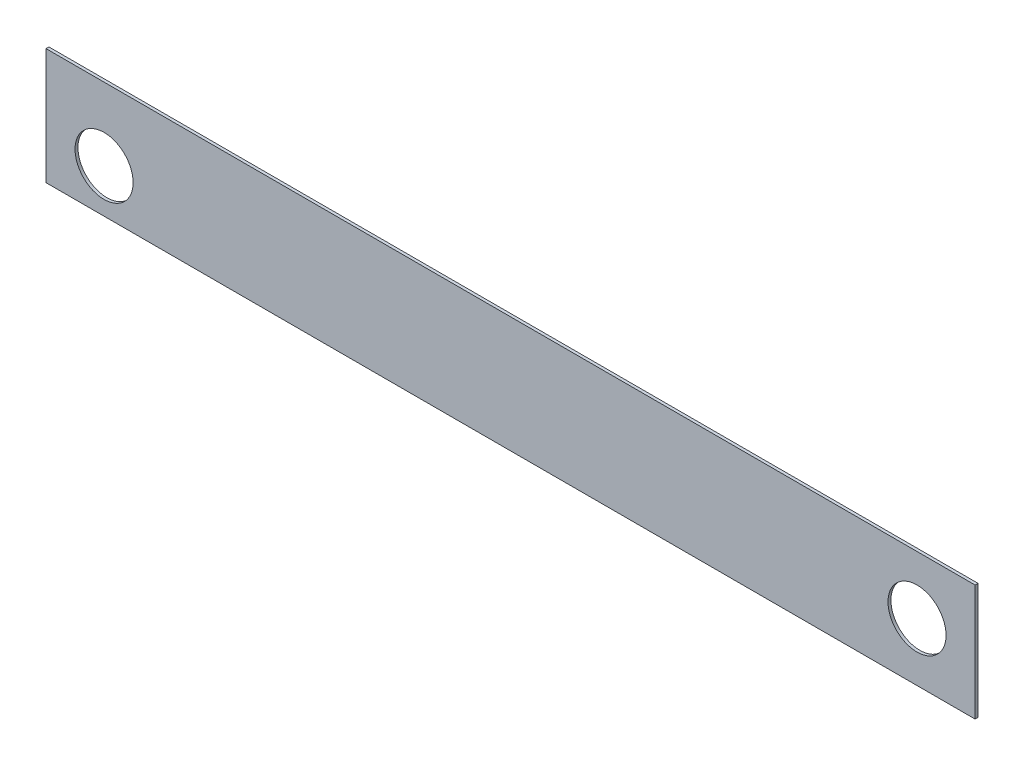
ISO-10303-21;
HEADER;
FILE_DESCRIPTION(('STEP AP214'),'2;1');
FILE_NAME('part.step','',(''),(''),'','','');
FILE_SCHEMA(('AUTOMOTIVE_DESIGN { 1 0 10303 214 1 1 1 1 }'));
ENDSEC;
DATA;
#1=APPLICATION_CONTEXT('core data for automotive mechanical design processes');
#2=APPLICATION_PROTOCOL_DEFINITION('international standard','automotive_design',2000,#1);
#3=PRODUCT_CONTEXT('',#1,'mechanical');
#4=PRODUCT('Part','Part','',(#3));
#5=PRODUCT_RELATED_PRODUCT_CATEGORY('part','',(#4));
#6=PRODUCT_DEFINITION_FORMATION('','',#4);
#7=PRODUCT_DEFINITION_CONTEXT('part definition',#1,'design');
#8=PRODUCT_DEFINITION('design','',#6,#7);
#9=PRODUCT_DEFINITION_SHAPE('','',#8);
#10=(LENGTH_UNIT() NAMED_UNIT(*) SI_UNIT(.MILLI.,.METRE.));
#11=(NAMED_UNIT(*) PLANE_ANGLE_UNIT() SI_UNIT($,.RADIAN.));
#12=(NAMED_UNIT(*) SI_UNIT($,.STERADIAN.) SOLID_ANGLE_UNIT());
#13=UNCERTAINTY_MEASURE_WITH_UNIT(LENGTH_MEASURE(1.E-05),#10,'distance_accuracy_value','');
#14=(GEOMETRIC_REPRESENTATION_CONTEXT(3) GLOBAL_UNCERTAINTY_ASSIGNED_CONTEXT((#13)) GLOBAL_UNIT_ASSIGNED_CONTEXT((#10,
#11,#12)) REPRESENTATION_CONTEXT('',''));
#15=CARTESIAN_POINT('',(0.,0.,0.));
#16=DIRECTION('',(0.,0.,1.));
#17=DIRECTION('',(1.,0.,0.));
#18=AXIS2_PLACEMENT_3D('',#15,#16,#17);
#19=CARTESIAN_POINT('',(-20.,25.,1.));
#20=DIRECTION('',(0.,0.,1.));
#21=DIRECTION('',(1.,0.,0.));
#22=AXIS2_PLACEMENT_3D('',#19,#20,#21);
#23=PLANE('',#22);
#24=CARTESIAN_POINT('',(0.,0.,1.));
#25=DIRECTION('',(0.,0.,1.));
#26=DIRECTION('',(1.,0.,0.));
#27=AXIS2_PLACEMENT_3D('',#24,#25,#26);
#28=CIRCLE('',#27,10.);
#29=CARTESIAN_POINT('',(10.,0.,1.));
#30=VERTEX_POINT('',#29);
#31=EDGE_CURVE('E106',#30,#30,#28,.T.);
#32=ORIENTED_EDGE('',*,*,#31,.F.);
#33=EDGE_LOOP('',(#32));
#34=FACE_BOUND('',#33,.T.);
#35=DIRECTION('',(0.,-1.,0.));
#36=VECTOR('',#35,1.);
#37=CARTESIAN_POINT('',(-20.,25.,1.));
#38=LINE('',#37,#36);
#39=CARTESIAN_POINT('',(-20.,25.,1.));
#40=VERTEX_POINT('',#39);
#41=CARTESIAN_POINT('',(-20.,-15.,1.));
#42=VERTEX_POINT('',#41);
#43=EDGE_CURVE('E91',#40,#42,#38,.T.);
#44=ORIENTED_EDGE('',*,*,#43,.T.);
#45=DIRECTION('',(1.,0.,0.));
#46=VECTOR('',#45,1.);
#47=CARTESIAN_POINT('',(-20.,-15.,1.));
#48=LINE('',#47,#46);
#49=CARTESIAN_POINT('',(300.,-15.,1.));
#50=VERTEX_POINT('',#49);
#51=EDGE_CURVE('E86',#42,#50,#48,.T.);
#52=ORIENTED_EDGE('',*,*,#51,.T.);
#53=DIRECTION('',(0.,1.,0.));
#54=VECTOR('',#53,1.);
#55=CARTESIAN_POINT('',(300.,25.,1.));
#56=LINE('',#55,#54);
#57=CARTESIAN_POINT('',(300.,25.,1.));
#58=VERTEX_POINT('',#57);
#59=EDGE_CURVE('E89',#50,#58,#56,.T.);
#60=ORIENTED_EDGE('',*,*,#59,.T.);
#61=DIRECTION('',(-1.,0.,0.));
#62=VECTOR('',#61,1.);
#63=CARTESIAN_POINT('',(-20.,25.,1.));
#64=LINE('',#63,#62);
#65=EDGE_CURVE('E56',#58,#40,#64,.T.);
#66=ORIENTED_EDGE('',*,*,#65,.T.);
#67=EDGE_LOOP('',(#44,#52,#60,#66));
#68=FACE_BOUND('',#67,.T.);
#69=CARTESIAN_POINT('',(280.,5.,1.));
#70=DIRECTION('',(0.,0.,1.));
#71=DIRECTION('',(1.,0.,0.));
#72=AXIS2_PLACEMENT_3D('',#69,#70,#71);
#73=CIRCLE('',#72,9.99999999999998);
#74=CARTESIAN_POINT('',(290.,5.,1.));
#75=VERTEX_POINT('',#74);
#76=EDGE_CURVE('E121',#75,#75,#73,.T.);
#77=ORIENTED_EDGE('',*,*,#76,.F.);
#78=EDGE_LOOP('',(#77));
#79=FACE_BOUND('',#78,.T.);
#80=ADVANCED_FACE('F39',(#34,#68,#79),#23,.T.);
#81=CARTESIAN_POINT('',(-20.,25.,0.));
#82=DIRECTION('',(0.,0.,1.));
#83=DIRECTION('',(1.,0.,0.));
#84=AXIS2_PLACEMENT_3D('',#81,#82,#83);
#85=PLANE('',#84);
#86=CARTESIAN_POINT('',(0.,0.,0.));
#87=DIRECTION('',(0.,0.,1.));
#88=DIRECTION('',(1.,0.,0.));
#89=AXIS2_PLACEMENT_3D('',#86,#87,#88);
#90=CIRCLE('',#89,10.);
#91=CARTESIAN_POINT('',(10.,0.,0.));
#92=VERTEX_POINT('',#91);
#93=EDGE_CURVE('E118',#92,#92,#90,.T.);
#94=ORIENTED_EDGE('',*,*,#93,.T.);
#95=EDGE_LOOP('',(#94));
#96=FACE_BOUND('',#95,.T.);
#97=DIRECTION('',(0.,-1.,0.));
#98=VECTOR('',#97,1.);
#99=CARTESIAN_POINT('',(-20.,25.,0.));
#100=LINE('',#99,#98);
#101=CARTESIAN_POINT('',(-20.,25.,0.));
#102=VERTEX_POINT('',#101);
#103=CARTESIAN_POINT('',(-20.,-15.,0.));
#104=VERTEX_POINT('',#103);
#105=EDGE_CURVE('E103',#102,#104,#100,.T.);
#106=ORIENTED_EDGE('',*,*,#105,.F.);
#107=DIRECTION('',(-1.,0.,0.));
#108=VECTOR('',#107,1.);
#109=CARTESIAN_POINT('',(-20.,25.,0.));
#110=LINE('',#109,#108);
#111=CARTESIAN_POINT('',(300.,25.,0.));
#112=VERTEX_POINT('',#111);
#113=EDGE_CURVE('E79',#112,#102,#110,.T.);
#114=ORIENTED_EDGE('',*,*,#113,.F.);
#115=DIRECTION('',(0.,1.,0.));
#116=VECTOR('',#115,1.);
#117=CARTESIAN_POINT('',(300.,25.,0.));
#118=LINE('',#117,#116);
#119=CARTESIAN_POINT('',(300.,-15.,0.));
#120=VERTEX_POINT('',#119);
#121=EDGE_CURVE('E73',#120,#112,#118,.T.);
#122=ORIENTED_EDGE('',*,*,#121,.F.);
#123=DIRECTION('',(1.,0.,0.));
#124=VECTOR('',#123,1.);
#125=CARTESIAN_POINT('',(-20.,-15.,0.));
#126=LINE('',#125,#124);
#127=EDGE_CURVE('E95',#104,#120,#126,.T.);
#128=ORIENTED_EDGE('',*,*,#127,.F.);
#129=EDGE_LOOP('',(#106,#114,#122,#128));
#130=FACE_BOUND('',#129,.T.);
#131=CARTESIAN_POINT('',(280.,5.,0.));
#132=DIRECTION('',(0.,0.,1.));
#133=DIRECTION('',(1.,0.,0.));
#134=AXIS2_PLACEMENT_3D('',#131,#132,#133);
#135=CIRCLE('',#134,9.99999999999998);
#136=CARTESIAN_POINT('',(290.,5.,0.));
#137=VERTEX_POINT('',#136);
#138=EDGE_CURVE('E124',#137,#137,#135,.T.);
#139=ORIENTED_EDGE('',*,*,#138,.T.);
#140=EDGE_LOOP('',(#139));
#141=FACE_BOUND('',#140,.T.);
#142=ADVANCED_FACE('F114',(#96,#130,#141),#85,.F.);
#143=CARTESIAN_POINT('',(-20.,25.,1.));
#144=DIRECTION('',(1.,0.,0.));
#145=DIRECTION('',(0.,1.,0.));
#146=AXIS2_PLACEMENT_3D('',#143,#144,#145);
#147=PLANE('',#146);
#148=ORIENTED_EDGE('',*,*,#105,.T.);
#149=DIRECTION('',(0.,0.,-1.));
#150=VECTOR('',#149,1.);
#151=CARTESIAN_POINT('',(-20.,-15.,1.));
#152=LINE('',#151,#150);
#153=EDGE_CURVE('E11',#42,#104,#152,.T.);
#154=ORIENTED_EDGE('',*,*,#153,.F.);
#155=ORIENTED_EDGE('',*,*,#43,.F.);
#156=DIRECTION('',(0.,0.,-1.));
#157=VECTOR('',#156,1.);
#158=CARTESIAN_POINT('',(-20.,25.,1.));
#159=LINE('',#158,#157);
#160=EDGE_CURVE('E99',#40,#102,#159,.T.);
#161=ORIENTED_EDGE('',*,*,#160,.T.);
#162=EDGE_LOOP('',(#148,#154,#155,#161));
#163=FACE_BOUND('',#162,.T.);
#164=ADVANCED_FACE('F41',(#163),#147,.F.);
#165=CARTESIAN_POINT('',(-20.,-15.,1.));
#166=DIRECTION('',(0.,1.,0.));
#167=DIRECTION('',(-1.,0.,0.));
#168=AXIS2_PLACEMENT_3D('',#165,#166,#167);
#169=PLANE('',#168);
#170=ORIENTED_EDGE('',*,*,#127,.T.);
#171=DIRECTION('',(0.,0.,-1.));
#172=VECTOR('',#171,1.);
#173=CARTESIAN_POINT('',(300.,-15.,1.));
#174=LINE('',#173,#172);
#175=EDGE_CURVE('E48',#50,#120,#174,.T.);
#176=ORIENTED_EDGE('',*,*,#175,.F.);
#177=ORIENTED_EDGE('',*,*,#51,.F.);
#178=ORIENTED_EDGE('',*,*,#153,.T.);
#179=EDGE_LOOP('',(#170,#176,#177,#178));
#180=FACE_BOUND('',#179,.T.);
#181=ADVANCED_FACE('F94',(#180),#169,.F.);
#182=CARTESIAN_POINT('',(300.,25.,1.));
#183=DIRECTION('',(-1.,0.,0.));
#184=DIRECTION('',(0.,0.,1.));
#185=AXIS2_PLACEMENT_3D('',#182,#183,#184);
#186=PLANE('',#185);
#187=ORIENTED_EDGE('',*,*,#121,.T.);
#188=DIRECTION('',(0.,0.,-1.));
#189=VECTOR('',#188,1.);
#190=CARTESIAN_POINT('',(300.,25.,1.));
#191=LINE('',#190,#189);
#192=EDGE_CURVE('E96',#58,#112,#191,.T.);
#193=ORIENTED_EDGE('',*,*,#192,.F.);
#194=ORIENTED_EDGE('',*,*,#59,.F.);
#195=ORIENTED_EDGE('',*,*,#175,.T.);
#196=EDGE_LOOP('',(#187,#193,#194,#195));
#197=FACE_BOUND('',#196,.T.);
#198=ADVANCED_FACE('F97',(#197),#186,.F.);
#199=CARTESIAN_POINT('',(-20.,25.,1.));
#200=DIRECTION('',(0.,-1.,0.));
#201=DIRECTION('',(0.,0.,-1.));
#202=AXIS2_PLACEMENT_3D('',#199,#200,#201);
#203=PLANE('',#202);
#204=ORIENTED_EDGE('',*,*,#113,.T.);
#205=ORIENTED_EDGE('',*,*,#160,.F.);
#206=ORIENTED_EDGE('',*,*,#65,.F.);
#207=ORIENTED_EDGE('',*,*,#192,.T.);
#208=EDGE_LOOP('',(#204,#205,#206,#207));
#209=FACE_BOUND('',#208,.T.);
#210=ADVANCED_FACE('F111',(#209),#203,.F.);
#211=CARTESIAN_POINT('',(0.,0.,1.));
#212=DIRECTION('',(0.,0.,-1.));
#213=DIRECTION('',(-1.,0.,0.));
#214=AXIS2_PLACEMENT_3D('',#211,#212,#213);
#215=CYLINDRICAL_SURFACE('',#214,10.);
#216=ORIENTED_EDGE('',*,*,#31,.T.);
#217=EDGE_LOOP('',(#216));
#218=FACE_BOUND('',#217,.T.);
#219=ORIENTED_EDGE('',*,*,#93,.F.);
#220=EDGE_LOOP('',(#219));
#221=FACE_BOUND('',#220,.T.);
#222=ADVANCED_FACE('F142',(#218,#221),#215,.F.);
#223=CARTESIAN_POINT('',(280.,5.,1.));
#224=DIRECTION('',(0.,0.,-1.));
#225=DIRECTION('',(-1.,0.,0.));
#226=AXIS2_PLACEMENT_3D('',#223,#224,#225);
#227=CYLINDRICAL_SURFACE('',#226,9.99999999999998);
#228=ORIENTED_EDGE('',*,*,#76,.T.);
#229=EDGE_LOOP('',(#228));
#230=FACE_BOUND('',#229,.T.);
#231=ORIENTED_EDGE('',*,*,#138,.F.);
#232=EDGE_LOOP('',(#231));
#233=FACE_BOUND('',#232,.T.);
#234=ADVANCED_FACE('F130',(#230,#233),#227,.F.);
#235=CLOSED_SHELL('',(#80,#142,#164,#181,#198,#210,#222,#234));
#236=MANIFOLD_SOLID_BREP('B2',#235);
#237=ADVANCED_BREP_SHAPE_REPRESENTATION('',(#18,#236),#14);
#238=SHAPE_DEFINITION_REPRESENTATION(#9,#237);
ENDSEC;
END-ISO-10303-21;
